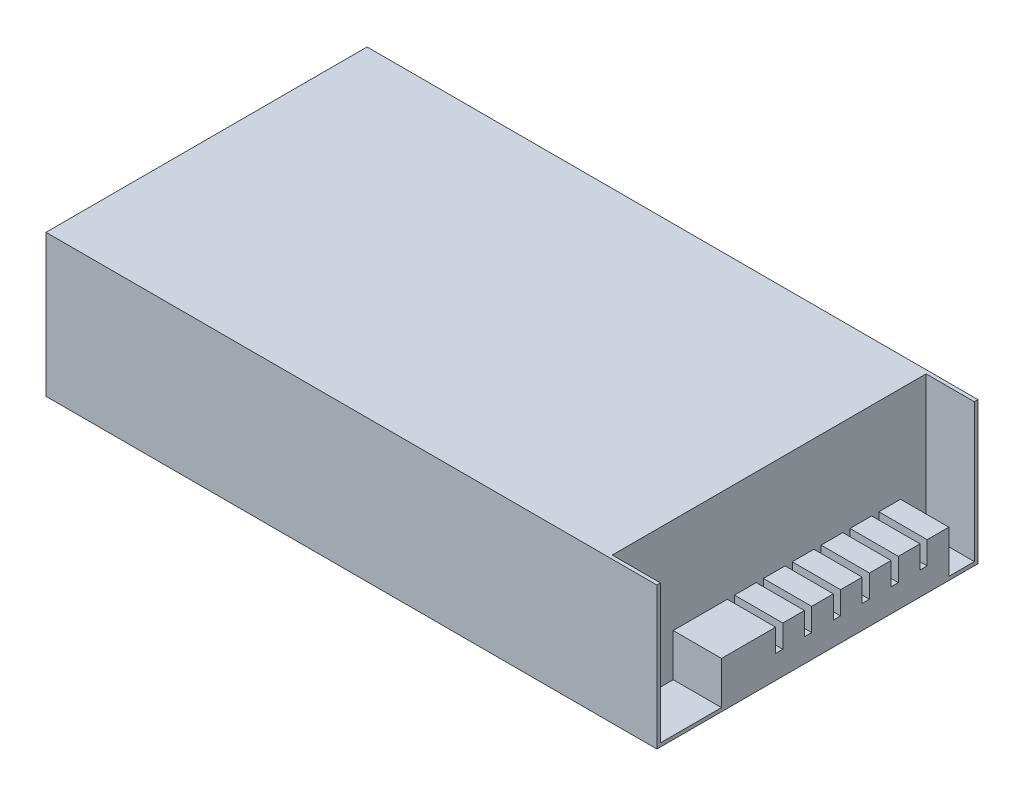
ISO-10303-21;
HEADER;
FILE_DESCRIPTION(('STEP AP214'),'2;1');
FILE_NAME('part.step','',(''),(''),'','','');
FILE_SCHEMA(('AUTOMOTIVE_DESIGN { 1 0 10303 214 1 1 1 1 }'));
ENDSEC;
DATA;
#1=APPLICATION_CONTEXT('core data for automotive mechanical design processes');
#2=APPLICATION_PROTOCOL_DEFINITION('international standard','automotive_design',2000,#1);
#3=PRODUCT_CONTEXT('',#1,'mechanical');
#4=PRODUCT('Part','Part','',(#3));
#5=PRODUCT_RELATED_PRODUCT_CATEGORY('part','',(#4));
#6=PRODUCT_DEFINITION_FORMATION('','',#4);
#7=PRODUCT_DEFINITION_CONTEXT('part definition',#1,'design');
#8=PRODUCT_DEFINITION('design','',#6,#7);
#9=PRODUCT_DEFINITION_SHAPE('','',#8);
#10=(LENGTH_UNIT() NAMED_UNIT(*) SI_UNIT(.MILLI.,.METRE.));
#11=(NAMED_UNIT(*) PLANE_ANGLE_UNIT() SI_UNIT($,.RADIAN.));
#12=(NAMED_UNIT(*) SI_UNIT($,.STERADIAN.) SOLID_ANGLE_UNIT());
#13=UNCERTAINTY_MEASURE_WITH_UNIT(LENGTH_MEASURE(1.E-05),#10,'distance_accuracy_value','');
#14=(GEOMETRIC_REPRESENTATION_CONTEXT(3) GLOBAL_UNCERTAINTY_ASSIGNED_CONTEXT((#13)) GLOBAL_UNIT_ASSIGNED_CONTEXT((#10,
#11,#12)) REPRESENTATION_CONTEXT('',''));
#15=CARTESIAN_POINT('',(0.,0.,0.));
#16=DIRECTION('',(0.,0.,1.));
#17=DIRECTION('',(1.,0.,0.));
#18=AXIS2_PLACEMENT_3D('',#15,#16,#17);
#19=CARTESIAN_POINT('',(215.,50.,0.));
#20=DIRECTION('',(-1.,0.,0.));
#21=DIRECTION('',(0.,0.,1.));
#22=AXIS2_PLACEMENT_3D('',#19,#20,#21);
#23=PLANE('',#22);
#24=DIRECTION('',(0.,1.,0.));
#25=VECTOR('',#24,1.);
#26=CARTESIAN_POINT('',(215.,8.27,-41.77));
#27=LINE('',#26,#25);
#28=CARTESIAN_POINT('',(215.,8.27,-41.77));
#29=VERTEX_POINT('',#28);
#30=CARTESIAN_POINT('',(215.,16.27,-41.77));
#31=VERTEX_POINT('',#30);
#32=EDGE_CURVE('E265',#29,#31,#27,.T.);
#33=ORIENTED_EDGE('',*,*,#32,.T.);
#34=DIRECTION('',(0.,0.,-1.));
#35=VECTOR('',#34,1.);
#36=CARTESIAN_POINT('',(215.,16.27,-22.73));
#37=LINE('',#36,#35);
#38=CARTESIAN_POINT('',(215.,16.27,-22.73));
#39=VERTEX_POINT('',#38);
#40=EDGE_CURVE('E442',#39,#31,#37,.T.);
#41=ORIENTED_EDGE('',*,*,#40,.F.);
#42=DIRECTION('',(0.,-1.,0.));
#43=VECTOR('',#42,1.);
#44=CARTESIAN_POINT('',(215.,16.27,-22.73));
#45=LINE('',#44,#43);
#46=CARTESIAN_POINT('',(215.,1.27,-22.73));
#47=VERTEX_POINT('',#46);
#48=EDGE_CURVE('E456',#39,#47,#45,.T.);
#49=ORIENTED_EDGE('',*,*,#48,.T.);
#50=DIRECTION('',(0.,0.,-1.));
#51=VECTOR('',#50,1.);
#52=CARTESIAN_POINT('',(215.,1.27,-1.27000000000001));
#53=LINE('',#52,#51);
#54=CARTESIAN_POINT('',(215.,1.27,-1.27000000000001));
#55=VERTEX_POINT('',#54);
#56=EDGE_CURVE('E491',#55,#47,#53,.T.);
#57=ORIENTED_EDGE('',*,*,#56,.F.);
#58=DIRECTION('',(0.,-1.,0.));
#59=VECTOR('',#58,1.);
#60=CARTESIAN_POINT('',(215.,50.,-1.27));
#61=LINE('',#60,#59);
#62=CARTESIAN_POINT('',(215.,50.,-1.27));
#63=VERTEX_POINT('',#62);
#64=EDGE_CURVE('E472',#63,#55,#61,.T.);
#65=ORIENTED_EDGE('',*,*,#64,.F.);
#66=DIRECTION('',(0.,0.,-1.));
#67=VECTOR('',#66,1.);
#68=CARTESIAN_POINT('',(215.,50.,0.));
#69=LINE('',#68,#67);
#70=CARTESIAN_POINT('',(215.,50.,0.));
#71=VERTEX_POINT('',#70);
#72=EDGE_CURVE('E512',#71,#63,#69,.T.);
#73=ORIENTED_EDGE('',*,*,#72,.F.);
#74=DIRECTION('',(0.,-1.,0.));
#75=VECTOR('',#74,1.);
#76=CARTESIAN_POINT('',(215.,50.,0.));
#77=LINE('',#76,#75);
#78=CARTESIAN_POINT('',(215.,0.,0.));
#79=VERTEX_POINT('',#78);
#80=EDGE_CURVE('E41',#71,#79,#77,.T.);
#81=ORIENTED_EDGE('',*,*,#80,.T.);
#82=DIRECTION('',(0.,0.,-1.));
#83=VECTOR('',#82,1.);
#84=CARTESIAN_POINT('',(215.,0.,0.));
#85=LINE('',#84,#83);
#86=CARTESIAN_POINT('',(215.,0.,-113.));
#87=VERTEX_POINT('',#86);
#88=EDGE_CURVE('E522',#79,#87,#85,.T.);
#89=ORIENTED_EDGE('',*,*,#88,.T.);
#90=DIRECTION('',(0.,-1.,0.));
#91=VECTOR('',#90,1.);
#92=CARTESIAN_POINT('',(215.,50.,-113.));
#93=LINE('',#92,#91);
#94=CARTESIAN_POINT('',(215.,50.,-113.));
#95=VERTEX_POINT('',#94);
#96=EDGE_CURVE('E527',#95,#87,#93,.T.);
#97=ORIENTED_EDGE('',*,*,#96,.F.);
#98=CARTESIAN_POINT('',(215.,50.,-111.73));
#99=VERTEX_POINT('',#98);
#100=EDGE_CURVE('E511',#99,#95,#69,.T.);
#101=ORIENTED_EDGE('',*,*,#100,.F.);
#102=DIRECTION('',(0.,-1.,0.));
#103=VECTOR('',#102,1.);
#104=CARTESIAN_POINT('',(215.,50.,-111.73));
#105=LINE('',#104,#103);
#106=CARTESIAN_POINT('',(215.,1.27,-111.73));
#107=VERTEX_POINT('',#106);
#108=EDGE_CURVE('E477',#99,#107,#105,.T.);
#109=ORIENTED_EDGE('',*,*,#108,.T.);
#110=CARTESIAN_POINT('',(215.,1.27,-102.73));
#111=VERTEX_POINT('',#110);
#112=EDGE_CURVE('E490',#111,#107,#53,.T.);
#113=ORIENTED_EDGE('',*,*,#112,.F.);
#114=DIRECTION('',(0.,-1.,0.));
#115=VECTOR('',#114,1.);
#116=CARTESIAN_POINT('',(215.,16.27,-102.73));
#117=LINE('',#116,#115);
#118=CARTESIAN_POINT('',(215.,16.27,-102.73));
#119=VERTEX_POINT('',#118);
#120=EDGE_CURVE('E469',#119,#111,#117,.T.);
#121=ORIENTED_EDGE('',*,*,#120,.F.);
#122=CARTESIAN_POINT('',(215.,16.27,-95.11));
#123=VERTEX_POINT('',#122);
#124=EDGE_CURVE('E446',#123,#119,#37,.T.);
#125=ORIENTED_EDGE('',*,*,#124,.F.);
#126=DIRECTION('',(0.,1.,0.));
#127=VECTOR('',#126,1.);
#128=CARTESIAN_POINT('',(215.,8.27,-95.11));
#129=LINE('',#128,#127);
#130=CARTESIAN_POINT('',(215.,8.27,-95.11));
#131=VERTEX_POINT('',#130);
#132=EDGE_CURVE('E426',#131,#123,#129,.T.);
#133=ORIENTED_EDGE('',*,*,#132,.F.);
#134=DIRECTION('',(0.,0.,-1.));
#135=VECTOR('',#134,1.);
#136=CARTESIAN_POINT('',(215.,8.27,0.));
#137=LINE('',#136,#135);
#138=CARTESIAN_POINT('',(215.,8.27,-92.57));
#139=VERTEX_POINT('',#138);
#140=EDGE_CURVE('E406',#139,#131,#137,.T.);
#141=ORIENTED_EDGE('',*,*,#140,.F.);
#142=DIRECTION('',(0.,1.,0.));
#143=VECTOR('',#142,1.);
#144=CARTESIAN_POINT('',(215.,8.27,-92.57));
#145=LINE('',#144,#143);
#146=CARTESIAN_POINT('',(215.,16.27,-92.57));
#147=VERTEX_POINT('',#146);
#148=EDGE_CURVE('E416',#139,#147,#145,.T.);
#149=ORIENTED_EDGE('',*,*,#148,.T.);
#150=CARTESIAN_POINT('',(215.,16.27,-84.95));
#151=VERTEX_POINT('',#150);
#152=EDGE_CURVE('E568',#151,#147,#37,.T.);
#153=ORIENTED_EDGE('',*,*,#152,.F.);
#154=DIRECTION('',(0.,1.,0.));
#155=VECTOR('',#154,1.);
#156=CARTESIAN_POINT('',(215.,8.27,-84.95));
#157=LINE('',#156,#155);
#158=CARTESIAN_POINT('',(215.,8.27,-84.95));
#159=VERTEX_POINT('',#158);
#160=EDGE_CURVE('E400',#159,#151,#157,.T.);
#161=ORIENTED_EDGE('',*,*,#160,.F.);
#162=DIRECTION('',(0.,0.,-1.));
#163=VECTOR('',#162,1.);
#164=CARTESIAN_POINT('',(215.,8.27,0.));
#165=LINE('',#164,#163);
#166=CARTESIAN_POINT('',(215.,8.27,-82.41));
#167=VERTEX_POINT('',#166);
#168=EDGE_CURVE('E380',#167,#159,#165,.T.);
#169=ORIENTED_EDGE('',*,*,#168,.F.);
#170=DIRECTION('',(0.,1.,0.));
#171=VECTOR('',#170,1.);
#172=CARTESIAN_POINT('',(215.,8.27,-82.41));
#173=LINE('',#172,#171);
#174=CARTESIAN_POINT('',(215.,16.27,-82.41));
#175=VERTEX_POINT('',#174);
#176=EDGE_CURVE('E390',#167,#175,#173,.T.);
#177=ORIENTED_EDGE('',*,*,#176,.T.);
#178=CARTESIAN_POINT('',(215.,16.27,-74.79));
#179=VERTEX_POINT('',#178);
#180=EDGE_CURVE('E569',#179,#175,#37,.T.);
#181=ORIENTED_EDGE('',*,*,#180,.F.);
#182=DIRECTION('',(0.,1.,0.));
#183=VECTOR('',#182,1.);
#184=CARTESIAN_POINT('',(215.,8.27,-74.79));
#185=LINE('',#184,#183);
#186=CARTESIAN_POINT('',(215.,8.27,-74.79));
#187=VERTEX_POINT('',#186);
#188=EDGE_CURVE('E374',#187,#179,#185,.T.);
#189=ORIENTED_EDGE('',*,*,#188,.F.);
#190=DIRECTION('',(0.,0.,-1.));
#191=VECTOR('',#190,1.);
#192=CARTESIAN_POINT('',(215.,8.27,0.));
#193=LINE('',#192,#191);
#194=CARTESIAN_POINT('',(215.,8.27,-72.25));
#195=VERTEX_POINT('',#194);
#196=EDGE_CURVE('E354',#195,#187,#193,.T.);
#197=ORIENTED_EDGE('',*,*,#196,.F.);
#198=DIRECTION('',(0.,1.,0.));
#199=VECTOR('',#198,1.);
#200=CARTESIAN_POINT('',(215.,8.27,-72.25));
#201=LINE('',#200,#199);
#202=CARTESIAN_POINT('',(215.,16.27,-72.25));
#203=VERTEX_POINT('',#202);
#204=EDGE_CURVE('E364',#195,#203,#201,.T.);
#205=ORIENTED_EDGE('',*,*,#204,.T.);
#206=CARTESIAN_POINT('',(215.,16.27,-64.63));
#207=VERTEX_POINT('',#206);
#208=EDGE_CURVE('E574',#207,#203,#37,.T.);
#209=ORIENTED_EDGE('',*,*,#208,.F.);
#210=DIRECTION('',(0.,1.,0.));
#211=VECTOR('',#210,1.);
#212=CARTESIAN_POINT('',(215.,8.27,-64.63));
#213=LINE('',#212,#211);
#214=CARTESIAN_POINT('',(215.,8.27,-64.63));
#215=VERTEX_POINT('',#214);
#216=EDGE_CURVE('E348',#215,#207,#213,.T.);
#217=ORIENTED_EDGE('',*,*,#216,.F.);
#218=DIRECTION('',(0.,0.,-1.));
#219=VECTOR('',#218,1.);
#220=CARTESIAN_POINT('',(215.,8.27,0.));
#221=LINE('',#220,#219);
#222=CARTESIAN_POINT('',(215.,8.27,-62.09));
#223=VERTEX_POINT('',#222);
#224=EDGE_CURVE('E328',#223,#215,#221,.T.);
#225=ORIENTED_EDGE('',*,*,#224,.F.);
#226=DIRECTION('',(0.,1.,0.));
#227=VECTOR('',#226,1.);
#228=CARTESIAN_POINT('',(215.,8.27,-62.09));
#229=LINE('',#228,#227);
#230=CARTESIAN_POINT('',(215.,16.27,-62.09));
#231=VERTEX_POINT('',#230);
#232=EDGE_CURVE('E338',#223,#231,#229,.T.);
#233=ORIENTED_EDGE('',*,*,#232,.T.);
#234=CARTESIAN_POINT('',(215.,16.27,-54.47));
#235=VERTEX_POINT('',#234);
#236=EDGE_CURVE('E579',#235,#231,#37,.T.);
#237=ORIENTED_EDGE('',*,*,#236,.F.);
#238=DIRECTION('',(0.,1.,0.));
#239=VECTOR('',#238,1.);
#240=CARTESIAN_POINT('',(215.,8.27,-54.47));
#241=LINE('',#240,#239);
#242=CARTESIAN_POINT('',(215.,8.27,-54.47));
#243=VERTEX_POINT('',#242);
#244=EDGE_CURVE('E322',#243,#235,#241,.T.);
#245=ORIENTED_EDGE('',*,*,#244,.F.);
#246=DIRECTION('',(0.,0.,-1.));
#247=VECTOR('',#246,1.);
#248=CARTESIAN_POINT('',(215.,8.27,0.));
#249=LINE('',#248,#247);
#250=CARTESIAN_POINT('',(215.,8.27,-51.93));
#251=VERTEX_POINT('',#250);
#252=EDGE_CURVE('E304',#251,#243,#249,.T.);
#253=ORIENTED_EDGE('',*,*,#252,.F.);
#254=DIRECTION('',(0.,1.,0.));
#255=VECTOR('',#254,1.);
#256=CARTESIAN_POINT('',(215.,8.27,-51.93));
#257=LINE('',#256,#255);
#258=CARTESIAN_POINT('',(215.,16.27,-51.93));
#259=VERTEX_POINT('',#258);
#260=EDGE_CURVE('E313',#251,#259,#257,.T.);
#261=ORIENTED_EDGE('',*,*,#260,.T.);
#262=CARTESIAN_POINT('',(215.,16.27,-44.31));
#263=VERTEX_POINT('',#262);
#264=EDGE_CURVE('E445',#263,#259,#37,.T.);
#265=ORIENTED_EDGE('',*,*,#264,.F.);
#266=DIRECTION('',(0.,1.,0.));
#267=VECTOR('',#266,1.);
#268=CARTESIAN_POINT('',(215.,8.27,-44.31));
#269=LINE('',#268,#267);
#270=CARTESIAN_POINT('',(215.,8.27,-44.31));
#271=VERTEX_POINT('',#270);
#272=EDGE_CURVE('E276',#271,#263,#269,.T.);
#273=ORIENTED_EDGE('',*,*,#272,.F.);
#274=DIRECTION('',(0.,0.,-1.));
#275=VECTOR('',#274,1.);
#276=CARTESIAN_POINT('',(215.,8.27,0.));
#277=LINE('',#276,#275);
#278=EDGE_CURVE('E284',#29,#271,#277,.T.);
#279=ORIENTED_EDGE('',*,*,#278,.F.);
#280=EDGE_LOOP('',(#33,#41,#49,#57,#65,#73,#81,#89,#97,#101,#109,#113,#121,#125,#133,#141,#149,
#153,#161,#169,#177,#181,#189,#197,#205,#209,#217,#225,#233,#237,#245,#253,#261,#265,#273,#279));
#281=FACE_BOUND('',#280,.T.);
#282=ADVANCED_FACE('F33',(#281),#23,.F.);
#283=CARTESIAN_POINT('',(0.,16.27,0.));
#284=DIRECTION('',(0.,1.,0.));
#285=DIRECTION('',(0.,0.,1.));
#286=AXIS2_PLACEMENT_3D('',#283,#284,#285);
#287=PLANE('',#286);
#288=ORIENTED_EDGE('',*,*,#40,.T.);
#289=DIRECTION('',(-1.,0.,0.));
#290=VECTOR('',#289,1.);
#291=CARTESIAN_POINT('',(0.,16.27,-41.77));
#292=LINE('',#291,#290);
#293=CARTESIAN_POINT('',(198.,16.27,-41.77));
#294=VERTEX_POINT('',#293);
#295=EDGE_CURVE('E271',#31,#294,#292,.T.);
#296=ORIENTED_EDGE('',*,*,#295,.T.);
#297=DIRECTION('',(0.,0.,1.));
#298=VECTOR('',#297,1.);
#299=CARTESIAN_POINT('',(198.,16.27,-22.73));
#300=LINE('',#299,#298);
#301=CARTESIAN_POINT('',(198.,16.27,-22.73));
#302=VERTEX_POINT('',#301);
#303=EDGE_CURVE('E449',#294,#302,#300,.T.);
#304=ORIENTED_EDGE('',*,*,#303,.T.);
#305=DIRECTION('',(1.,0.,0.));
#306=VECTOR('',#305,1.);
#307=CARTESIAN_POINT('',(215.,16.27,-22.73));
#308=LINE('',#307,#306);
#309=EDGE_CURVE('E453',#302,#39,#308,.T.);
#310=ORIENTED_EDGE('',*,*,#309,.T.);
#311=EDGE_LOOP('',(#288,#296,#304,#310));
#312=FACE_BOUND('',#311,.T.);
#313=ADVANCED_FACE('F610',(#312),#287,.T.);
#314=DIRECTION('',(-1.,0.,0.));
#315=VECTOR('',#314,1.);
#316=CARTESIAN_POINT('',(0.,16.27,-44.31));
#317=LINE('',#316,#315);
#318=CARTESIAN_POINT('',(198.,16.27,-44.31));
#319=VERTEX_POINT('',#318);
#320=EDGE_CURVE('E48',#263,#319,#317,.T.);
#321=ORIENTED_EDGE('',*,*,#320,.F.);
#322=ORIENTED_EDGE('',*,*,#264,.T.);
#323=DIRECTION('',(-1.,0.,0.));
#324=VECTOR('',#323,1.);
#325=CARTESIAN_POINT('',(0.,16.27,-51.93));
#326=LINE('',#325,#324);
#327=CARTESIAN_POINT('',(198.,16.27,-51.93));
#328=VERTEX_POINT('',#327);
#329=EDGE_CURVE('E298',#259,#328,#326,.T.);
#330=ORIENTED_EDGE('',*,*,#329,.T.);
#331=EDGE_CURVE('E603',#328,#319,#300,.T.);
#332=ORIENTED_EDGE('',*,*,#331,.T.);
#333=EDGE_LOOP('',(#321,#322,#330,#332));
#334=FACE_BOUND('',#333,.T.);
#335=ADVANCED_FACE('F589',(#334),#287,.T.);
#336=DIRECTION('',(-1.,0.,0.));
#337=VECTOR('',#336,1.);
#338=CARTESIAN_POINT('',(0.,16.27,-54.47));
#339=LINE('',#338,#337);
#340=CARTESIAN_POINT('',(198.,16.27,-54.47));
#341=VERTEX_POINT('',#340);
#342=EDGE_CURVE('E56',#235,#341,#339,.T.);
#343=ORIENTED_EDGE('',*,*,#342,.F.);
#344=ORIENTED_EDGE('',*,*,#236,.T.);
#345=DIRECTION('',(-1.,0.,0.));
#346=VECTOR('',#345,1.);
#347=CARTESIAN_POINT('',(0.,16.27,-62.09));
#348=LINE('',#347,#346);
#349=CARTESIAN_POINT('',(198.,16.27,-62.09));
#350=VERTEX_POINT('',#349);
#351=EDGE_CURVE('E319',#231,#350,#348,.T.);
#352=ORIENTED_EDGE('',*,*,#351,.T.);
#353=EDGE_CURVE('E604',#350,#341,#300,.T.);
#354=ORIENTED_EDGE('',*,*,#353,.T.);
#355=EDGE_LOOP('',(#343,#344,#352,#354));
#356=FACE_BOUND('',#355,.T.);
#357=ADVANCED_FACE('F852',(#356),#287,.T.);
#358=DIRECTION('',(-1.,0.,0.));
#359=VECTOR('',#358,1.);
#360=CARTESIAN_POINT('',(0.,16.27,-64.63));
#361=LINE('',#360,#359);
#362=CARTESIAN_POINT('',(198.,16.27,-64.63));
#363=VERTEX_POINT('',#362);
#364=EDGE_CURVE('E329',#207,#363,#361,.T.);
#365=ORIENTED_EDGE('',*,*,#364,.F.);
#366=ORIENTED_EDGE('',*,*,#208,.T.);
#367=DIRECTION('',(-1.,0.,0.));
#368=VECTOR('',#367,1.);
#369=CARTESIAN_POINT('',(0.,16.27,-72.25));
#370=LINE('',#369,#368);
#371=CARTESIAN_POINT('',(198.,16.27,-72.25));
#372=VERTEX_POINT('',#371);
#373=EDGE_CURVE('E344',#203,#372,#370,.T.);
#374=ORIENTED_EDGE('',*,*,#373,.T.);
#375=EDGE_CURVE('E606',#372,#363,#300,.T.);
#376=ORIENTED_EDGE('',*,*,#375,.T.);
#377=EDGE_LOOP('',(#365,#366,#374,#376));
#378=FACE_BOUND('',#377,.T.);
#379=ADVANCED_FACE('F860',(#378),#287,.T.);
#380=DIRECTION('',(-1.,0.,0.));
#381=VECTOR('',#380,1.);
#382=CARTESIAN_POINT('',(0.,16.27,-74.79));
#383=LINE('',#382,#381);
#384=CARTESIAN_POINT('',(198.,16.27,-74.79));
#385=VERTEX_POINT('',#384);
#386=EDGE_CURVE('E355',#179,#385,#383,.T.);
#387=ORIENTED_EDGE('',*,*,#386,.F.);
#388=ORIENTED_EDGE('',*,*,#180,.T.);
#389=DIRECTION('',(-1.,0.,0.));
#390=VECTOR('',#389,1.);
#391=CARTESIAN_POINT('',(0.,16.27,-82.41));
#392=LINE('',#391,#390);
#393=CARTESIAN_POINT('',(198.,16.27,-82.41));
#394=VERTEX_POINT('',#393);
#395=EDGE_CURVE('E370',#175,#394,#392,.T.);
#396=ORIENTED_EDGE('',*,*,#395,.T.);
#397=EDGE_CURVE('E1037',#394,#385,#300,.T.);
#398=ORIENTED_EDGE('',*,*,#397,.T.);
#399=EDGE_LOOP('',(#387,#388,#396,#398));
#400=FACE_BOUND('',#399,.T.);
#401=ADVANCED_FACE('F639',(#400),#287,.T.);
#402=DIRECTION('',(-1.,0.,0.));
#403=VECTOR('',#402,1.);
#404=CARTESIAN_POINT('',(0.,16.27,-84.95));
#405=LINE('',#404,#403);
#406=CARTESIAN_POINT('',(198.,16.27,-84.95));
#407=VERTEX_POINT('',#406);
#408=EDGE_CURVE('E381',#151,#407,#405,.T.);
#409=ORIENTED_EDGE('',*,*,#408,.F.);
#410=ORIENTED_EDGE('',*,*,#152,.T.);
#411=DIRECTION('',(-1.,0.,0.));
#412=VECTOR('',#411,1.);
#413=CARTESIAN_POINT('',(0.,16.27,-92.57));
#414=LINE('',#413,#412);
#415=CARTESIAN_POINT('',(198.,16.27,-92.57));
#416=VERTEX_POINT('',#415);
#417=EDGE_CURVE('E396',#147,#416,#414,.T.);
#418=ORIENTED_EDGE('',*,*,#417,.T.);
#419=EDGE_CURVE('E454',#416,#407,#300,.T.);
#420=ORIENTED_EDGE('',*,*,#419,.T.);
#421=EDGE_LOOP('',(#409,#410,#418,#420));
#422=FACE_BOUND('',#421,.T.);
#423=ADVANCED_FACE('F628',(#422),#287,.T.);
#424=CARTESIAN_POINT('',(198.,1.27,-1.27000000000001));
#425=DIRECTION('',(0.,-1.,0.));
#426=DIRECTION('',(0.,0.,-1.));
#427=AXIS2_PLACEMENT_3D('',#424,#425,#426);
#428=PLANE('',#427);
#429=DIRECTION('',(-1.,0.,0.));
#430=VECTOR('',#429,1.);
#431=CARTESIAN_POINT('',(215.,1.27,-102.73));
#432=LINE('',#431,#430);
#433=CARTESIAN_POINT('',(198.,1.27,-102.73));
#434=VERTEX_POINT('',#433);
#435=EDGE_CURVE('E439',#111,#434,#432,.T.);
#436=ORIENTED_EDGE('',*,*,#435,.F.);
#437=ORIENTED_EDGE('',*,*,#112,.T.);
#438=DIRECTION('',(1.,0.,0.));
#439=VECTOR('',#438,1.);
#440=CARTESIAN_POINT('',(198.,1.27,-111.73));
#441=LINE('',#440,#439);
#442=CARTESIAN_POINT('',(198.,1.27,-111.73));
#443=VERTEX_POINT('',#442);
#444=EDGE_CURVE('E501',#443,#107,#441,.T.);
#445=ORIENTED_EDGE('',*,*,#444,.F.);
#446=DIRECTION('',(0.,0.,-1.));
#447=VECTOR('',#446,1.);
#448=CARTESIAN_POINT('',(198.,1.27,-1.27000000000001));
#449=LINE('',#448,#447);
#450=EDGE_CURVE('E476',#434,#443,#449,.T.);
#451=ORIENTED_EDGE('',*,*,#450,.F.);
#452=EDGE_LOOP('',(#436,#437,#445,#451));
#453=FACE_BOUND('',#452,.T.);
#454=ADVANCED_FACE('F558',(#453),#428,.F.);
#455=DIRECTION('',(1.,0.,0.));
#456=VECTOR('',#455,1.);
#457=CARTESIAN_POINT('',(215.,1.27,-22.73));
#458=LINE('',#457,#456);
#459=CARTESIAN_POINT('',(198.,1.27,-22.73));
#460=VERTEX_POINT('',#459);
#461=EDGE_CURVE('E459',#460,#47,#458,.T.);
#462=ORIENTED_EDGE('',*,*,#461,.F.);
#463=CARTESIAN_POINT('',(198.,1.27,-1.27000000000001));
#464=VERTEX_POINT('',#463);
#465=EDGE_CURVE('E478',#464,#460,#449,.T.);
#466=ORIENTED_EDGE('',*,*,#465,.F.);
#467=DIRECTION('',(1.,0.,0.));
#468=VECTOR('',#467,1.);
#469=CARTESIAN_POINT('',(198.,1.27,-1.27000000000001));
#470=LINE('',#469,#468);
#471=EDGE_CURVE('E487',#464,#55,#470,.T.);
#472=ORIENTED_EDGE('',*,*,#471,.T.);
#473=ORIENTED_EDGE('',*,*,#56,.T.);
#474=EDGE_LOOP('',(#462,#466,#472,#473));
#475=FACE_BOUND('',#474,.T.);
#476=ADVANCED_FACE('F618',(#475),#428,.F.);
#477=CARTESIAN_POINT('',(198.,0.,0.));
#478=DIRECTION('',(1.,0.,0.));
#479=DIRECTION('',(0.,0.,-1.));
#480=AXIS2_PLACEMENT_3D('',#477,#478,#479);
#481=PLANE('',#480);
#482=CARTESIAN_POINT('',(198.,16.27,-102.73));
#483=VERTEX_POINT('',#482);
#484=CARTESIAN_POINT('',(198.,16.27,-95.11));
#485=VERTEX_POINT('',#484);
#486=EDGE_CURVE('E450',#483,#485,#300,.T.);
#487=ORIENTED_EDGE('',*,*,#486,.F.);
#488=DIRECTION('',(0.,-1.,0.));
#489=VECTOR('',#488,1.);
#490=CARTESIAN_POINT('',(198.,16.27,-102.73));
#491=LINE('',#490,#489);
#492=EDGE_CURVE('E467',#483,#434,#491,.T.);
#493=ORIENTED_EDGE('',*,*,#492,.T.);
#494=ORIENTED_EDGE('',*,*,#450,.T.);
#495=DIRECTION('',(0.,-1.,0.));
#496=VECTOR('',#495,1.);
#497=CARTESIAN_POINT('',(198.,50.,-111.73));
#498=LINE('',#497,#496);
#499=CARTESIAN_POINT('',(198.,50.,-111.73));
#500=VERTEX_POINT('',#499);
#501=EDGE_CURVE('E481',#500,#443,#498,.T.);
#502=ORIENTED_EDGE('',*,*,#501,.F.);
#503=DIRECTION('',(0.,0.,-1.));
#504=VECTOR('',#503,1.);
#505=CARTESIAN_POINT('',(198.,50.,-1.27));
#506=LINE('',#505,#504);
#507=CARTESIAN_POINT('',(198.,50.,-1.27));
#508=VERTEX_POINT('',#507);
#509=EDGE_CURVE('E484',#508,#500,#506,.T.);
#510=ORIENTED_EDGE('',*,*,#509,.F.);
#511=DIRECTION('',(0.,-1.,0.));
#512=VECTOR('',#511,1.);
#513=CARTESIAN_POINT('',(198.,50.,-1.27));
#514=LINE('',#513,#512);
#515=EDGE_CURVE('E473',#508,#464,#514,.T.);
#516=ORIENTED_EDGE('',*,*,#515,.T.);
#517=ORIENTED_EDGE('',*,*,#465,.T.);
#518=DIRECTION('',(0.,-1.,0.));
#519=VECTOR('',#518,1.);
#520=CARTESIAN_POINT('',(198.,16.27,-22.73));
#521=LINE('',#520,#519);
#522=EDGE_CURVE('E464',#302,#460,#521,.T.);
#523=ORIENTED_EDGE('',*,*,#522,.F.);
#524=ORIENTED_EDGE('',*,*,#303,.F.);
#525=DIRECTION('',(0.,1.,0.));
#526=VECTOR('',#525,1.);
#527=CARTESIAN_POINT('',(198.,8.27,-41.77));
#528=LINE('',#527,#526);
#529=CARTESIAN_POINT('',(198.,8.27,-41.77));
#530=VERTEX_POINT('',#529);
#531=EDGE_CURVE('E296',#530,#294,#528,.T.);
#532=ORIENTED_EDGE('',*,*,#531,.F.);
#533=DIRECTION('',(0.,0.,1.));
#534=VECTOR('',#533,1.);
#535=CARTESIAN_POINT('',(198.,8.27,0.));
#536=LINE('',#535,#534);
#537=CARTESIAN_POINT('',(198.,8.27,-44.31));
#538=VERTEX_POINT('',#537);
#539=EDGE_CURVE('E277',#538,#530,#536,.T.);
#540=ORIENTED_EDGE('',*,*,#539,.F.);
#541=DIRECTION('',(0.,1.,0.));
#542=VECTOR('',#541,1.);
#543=CARTESIAN_POINT('',(198.,8.27,-44.31));
#544=LINE('',#543,#542);
#545=EDGE_CURVE('E299',#538,#319,#544,.T.);
#546=ORIENTED_EDGE('',*,*,#545,.T.);
#547=ORIENTED_EDGE('',*,*,#331,.F.);
#548=DIRECTION('',(0.,1.,0.));
#549=VECTOR('',#548,1.);
#550=CARTESIAN_POINT('',(198.,8.27,-51.93));
#551=LINE('',#550,#549);
#552=CARTESIAN_POINT('',(198.,8.27,-51.93));
#553=VERTEX_POINT('',#552);
#554=EDGE_CURVE('E317',#553,#328,#551,.T.);
#555=ORIENTED_EDGE('',*,*,#554,.F.);
#556=DIRECTION('',(0.,0.,1.));
#557=VECTOR('',#556,1.);
#558=CARTESIAN_POINT('',(198.,8.27,0.));
#559=LINE('',#558,#557);
#560=CARTESIAN_POINT('',(198.,8.27,-54.47));
#561=VERTEX_POINT('',#560);
#562=EDGE_CURVE('E310',#561,#553,#559,.T.);
#563=ORIENTED_EDGE('',*,*,#562,.F.);
#564=DIRECTION('',(0.,1.,0.));
#565=VECTOR('',#564,1.);
#566=CARTESIAN_POINT('',(198.,8.27,-54.47));
#567=LINE('',#566,#565);
#568=EDGE_CURVE('E320',#561,#341,#567,.T.);
#569=ORIENTED_EDGE('',*,*,#568,.T.);
#570=ORIENTED_EDGE('',*,*,#353,.F.);
#571=DIRECTION('',(0.,1.,0.));
#572=VECTOR('',#571,1.);
#573=CARTESIAN_POINT('',(198.,8.27,-62.09));
#574=LINE('',#573,#572);
#575=CARTESIAN_POINT('',(198.,8.27,-62.09));
#576=VERTEX_POINT('',#575);
#577=EDGE_CURVE('E342',#576,#350,#574,.T.);
#578=ORIENTED_EDGE('',*,*,#577,.F.);
#579=DIRECTION('',(0.,0.,1.));
#580=VECTOR('',#579,1.);
#581=CARTESIAN_POINT('',(198.,8.27,0.));
#582=LINE('',#581,#580);
#583=CARTESIAN_POINT('',(198.,8.27,-64.63));
#584=VERTEX_POINT('',#583);
#585=EDGE_CURVE('E335',#584,#576,#582,.T.);
#586=ORIENTED_EDGE('',*,*,#585,.F.);
#587=DIRECTION('',(0.,1.,0.));
#588=VECTOR('',#587,1.);
#589=CARTESIAN_POINT('',(198.,8.27,-64.63));
#590=LINE('',#589,#588);
#591=EDGE_CURVE('E345',#584,#363,#590,.T.);
#592=ORIENTED_EDGE('',*,*,#591,.T.);
#593=ORIENTED_EDGE('',*,*,#375,.F.);
#594=DIRECTION('',(0.,1.,0.));
#595=VECTOR('',#594,1.);
#596=CARTESIAN_POINT('',(198.,8.27,-72.25));
#597=LINE('',#596,#595);
#598=CARTESIAN_POINT('',(198.,8.27,-72.25));
#599=VERTEX_POINT('',#598);
#600=EDGE_CURVE('E368',#599,#372,#597,.T.);
#601=ORIENTED_EDGE('',*,*,#600,.F.);
#602=DIRECTION('',(0.,0.,1.));
#603=VECTOR('',#602,1.);
#604=CARTESIAN_POINT('',(198.,8.27,0.));
#605=LINE('',#604,#603);
#606=CARTESIAN_POINT('',(198.,8.27,-74.79));
#607=VERTEX_POINT('',#606);
#608=EDGE_CURVE('E361',#607,#599,#605,.T.);
#609=ORIENTED_EDGE('',*,*,#608,.F.);
#610=DIRECTION('',(0.,1.,0.));
#611=VECTOR('',#610,1.);
#612=CARTESIAN_POINT('',(198.,8.27,-74.79));
#613=LINE('',#612,#611);
#614=EDGE_CURVE('E371',#607,#385,#613,.T.);
#615=ORIENTED_EDGE('',*,*,#614,.T.);
#616=ORIENTED_EDGE('',*,*,#397,.F.);
#617=DIRECTION('',(0.,1.,0.));
#618=VECTOR('',#617,1.);
#619=CARTESIAN_POINT('',(198.,8.27,-82.41));
#620=LINE('',#619,#618);
#621=CARTESIAN_POINT('',(198.,8.27,-82.41));
#622=VERTEX_POINT('',#621);
#623=EDGE_CURVE('E394',#622,#394,#620,.T.);
#624=ORIENTED_EDGE('',*,*,#623,.F.);
#625=DIRECTION('',(0.,0.,1.));
#626=VECTOR('',#625,1.);
#627=CARTESIAN_POINT('',(198.,8.27,0.));
#628=LINE('',#627,#626);
#629=CARTESIAN_POINT('',(198.,8.27,-84.95));
#630=VERTEX_POINT('',#629);
#631=EDGE_CURVE('E387',#630,#622,#628,.T.);
#632=ORIENTED_EDGE('',*,*,#631,.F.);
#633=DIRECTION('',(0.,1.,0.));
#634=VECTOR('',#633,1.);
#635=CARTESIAN_POINT('',(198.,8.27,-84.95));
#636=LINE('',#635,#634);
#637=EDGE_CURVE('E397',#630,#407,#636,.T.);
#638=ORIENTED_EDGE('',*,*,#637,.T.);
#639=ORIENTED_EDGE('',*,*,#419,.F.);
#640=DIRECTION('',(0.,1.,0.));
#641=VECTOR('',#640,1.);
#642=CARTESIAN_POINT('',(198.,8.27,-92.57));
#643=LINE('',#642,#641);
#644=CARTESIAN_POINT('',(198.,8.27,-92.57));
#645=VERTEX_POINT('',#644);
#646=EDGE_CURVE('E421',#645,#416,#643,.T.);
#647=ORIENTED_EDGE('',*,*,#646,.F.);
#648=DIRECTION('',(0.,0.,1.));
#649=VECTOR('',#648,1.);
#650=CARTESIAN_POINT('',(198.,8.27,0.));
#651=LINE('',#650,#649);
#652=CARTESIAN_POINT('',(198.,8.27,-95.11));
#653=VERTEX_POINT('',#652);
#654=EDGE_CURVE('E413',#653,#645,#651,.T.);
#655=ORIENTED_EDGE('',*,*,#654,.F.);
#656=DIRECTION('',(0.,1.,0.));
#657=VECTOR('',#656,1.);
#658=CARTESIAN_POINT('',(198.,8.27,-95.11));
#659=LINE('',#658,#657);
#660=EDGE_CURVE('E424',#653,#485,#659,.T.);
#661=ORIENTED_EDGE('',*,*,#660,.T.);
#662=EDGE_LOOP('',(#487,#493,#494,#502,#510,#516,#517,#523,#524,#532,#540,#546,#547,#555,#563,
#569,#570,#578,#586,#592,#593,#601,#609,#615,#616,#624,#632,#638,#639,#647,#655,#661));
#663=FACE_BOUND('',#662,.T.);
#664=ADVANCED_FACE('F602',(#663),#481,.T.);
#665=CARTESIAN_POINT('',(0.,50.,0.));
#666=DIRECTION('',(1.,0.,0.));
#667=DIRECTION('',(0.,0.,-1.));
#668=AXIS2_PLACEMENT_3D('',#665,#666,#667);
#669=PLANE('',#668);
#670=DIRECTION('',(0.,0.,1.));
#671=VECTOR('',#670,1.);
#672=CARTESIAN_POINT('',(0.,0.,0.));
#673=LINE('',#672,#671);
#674=CARTESIAN_POINT('',(0.,0.,-113.));
#675=VERTEX_POINT('',#674);
#676=CARTESIAN_POINT('',(0.,0.,0.));
#677=VERTEX_POINT('',#676);
#678=EDGE_CURVE('E497',#675,#677,#673,.T.);
#679=ORIENTED_EDGE('',*,*,#678,.T.);
#680=DIRECTION('',(0.,-1.,0.));
#681=VECTOR('',#680,1.);
#682=CARTESIAN_POINT('',(0.,50.,0.));
#683=LINE('',#682,#681);
#684=CARTESIAN_POINT('',(0.,50.,0.));
#685=VERTEX_POINT('',#684);
#686=EDGE_CURVE('E11',#685,#677,#683,.T.);
#687=ORIENTED_EDGE('',*,*,#686,.F.);
#688=DIRECTION('',(0.,0.,1.));
#689=VECTOR('',#688,1.);
#690=CARTESIAN_POINT('',(0.,50.,0.));
#691=LINE('',#690,#689);
#692=CARTESIAN_POINT('',(0.,50.,-113.));
#693=VERTEX_POINT('',#692);
#694=EDGE_CURVE('E505',#693,#685,#691,.T.);
#695=ORIENTED_EDGE('',*,*,#694,.F.);
#696=DIRECTION('',(0.,-1.,0.));
#697=VECTOR('',#696,1.);
#698=CARTESIAN_POINT('',(0.,50.,-113.));
#699=LINE('',#698,#697);
#700=EDGE_CURVE('E517',#693,#675,#699,.T.);
#701=ORIENTED_EDGE('',*,*,#700,.T.);
#702=EDGE_LOOP('',(#679,#687,#695,#701));
#703=FACE_BOUND('',#702,.T.);
#704=ADVANCED_FACE('F35',(#703),#669,.F.);
#705=CARTESIAN_POINT('',(0.,50.,0.));
#706=DIRECTION('',(0.,0.,-1.));
#707=DIRECTION('',(-1.,0.,0.));
#708=AXIS2_PLACEMENT_3D('',#705,#706,#707);
#709=PLANE('',#708);
#710=DIRECTION('',(1.,0.,0.));
#711=VECTOR('',#710,1.);
#712=CARTESIAN_POINT('',(0.,0.,0.));
#713=LINE('',#712,#711);
#714=EDGE_CURVE('E520',#677,#79,#713,.T.);
#715=ORIENTED_EDGE('',*,*,#714,.T.);
#716=ORIENTED_EDGE('',*,*,#80,.F.);
#717=DIRECTION('',(1.,0.,0.));
#718=VECTOR('',#717,1.);
#719=CARTESIAN_POINT('',(0.,50.,0.));
#720=LINE('',#719,#718);
#721=EDGE_CURVE('E508',#685,#71,#720,.T.);
#722=ORIENTED_EDGE('',*,*,#721,.F.);
#723=ORIENTED_EDGE('',*,*,#686,.T.);
#724=EDGE_LOOP('',(#715,#716,#722,#723));
#725=FACE_BOUND('',#724,.T.);
#726=ADVANCED_FACE('F646',(#725),#709,.F.);
#727=CARTESIAN_POINT('',(0.,50.,-113.));
#728=DIRECTION('',(0.,0.,1.));
#729=DIRECTION('',(1.,0.,0.));
#730=AXIS2_PLACEMENT_3D('',#727,#728,#729);
#731=PLANE('',#730);
#732=DIRECTION('',(-1.,0.,0.));
#733=VECTOR('',#732,1.);
#734=CARTESIAN_POINT('',(0.,0.,-113.));
#735=LINE('',#734,#733);
#736=EDGE_CURVE('E509',#87,#675,#735,.T.);
#737=ORIENTED_EDGE('',*,*,#736,.T.);
#738=ORIENTED_EDGE('',*,*,#700,.F.);
#739=DIRECTION('',(-1.,0.,0.));
#740=VECTOR('',#739,1.);
#741=CARTESIAN_POINT('',(0.,50.,-113.));
#742=LINE('',#741,#740);
#743=EDGE_CURVE('E515',#95,#693,#742,.T.);
#744=ORIENTED_EDGE('',*,*,#743,.F.);
#745=ORIENTED_EDGE('',*,*,#96,.T.);
#746=EDGE_LOOP('',(#737,#738,#744,#745));
#747=FACE_BOUND('',#746,.T.);
#748=ADVANCED_FACE('F542',(#747),#731,.F.);
#749=CARTESIAN_POINT('',(0.,50.,0.));
#750=DIRECTION('',(0.,-1.,0.));
#751=DIRECTION('',(0.,0.,-1.));
#752=AXIS2_PLACEMENT_3D('',#749,#750,#751);
#753=PLANE('',#752);
#754=ORIENTED_EDGE('',*,*,#72,.T.);
#755=DIRECTION('',(1.,0.,0.));
#756=VECTOR('',#755,1.);
#757=CARTESIAN_POINT('',(198.,50.,-1.27));
#758=LINE('',#757,#756);
#759=EDGE_CURVE('E495',#508,#63,#758,.T.);
#760=ORIENTED_EDGE('',*,*,#759,.F.);
#761=ORIENTED_EDGE('',*,*,#509,.T.);
#762=DIRECTION('',(1.,0.,0.));
#763=VECTOR('',#762,1.);
#764=CARTESIAN_POINT('',(198.,50.,-111.73));
#765=LINE('',#764,#763);
#766=EDGE_CURVE('E498',#500,#99,#765,.T.);
#767=ORIENTED_EDGE('',*,*,#766,.T.);
#768=ORIENTED_EDGE('',*,*,#100,.T.);
#769=ORIENTED_EDGE('',*,*,#743,.T.);
#770=ORIENTED_EDGE('',*,*,#694,.T.);
#771=ORIENTED_EDGE('',*,*,#721,.T.);
#772=EDGE_LOOP('',(#754,#760,#761,#767,#768,#769,#770,#771));
#773=FACE_BOUND('',#772,.T.);
#774=ADVANCED_FACE('F548',(#773),#753,.F.);
#775=CARTESIAN_POINT('',(0.,0.,0.));
#776=DIRECTION('',(0.,-1.,0.));
#777=DIRECTION('',(0.,0.,-1.));
#778=AXIS2_PLACEMENT_3D('',#775,#776,#777);
#779=PLANE('',#778);
#780=CARTESIAN_POINT('',(190.87,0.,-65.278));
#781=DIRECTION('',(0.,-1.,0.));
#782=DIRECTION('',(0.,0.,-1.));
#783=AXIS2_PLACEMENT_3D('',#780,#781,#782);
#784=CIRCLE('',#783,1.27000000000001);
#785=CARTESIAN_POINT('',(190.87,0.,-66.548));
#786=VERTEX_POINT('',#785);
#787=EDGE_CURVE('E423',#786,#786,#784,.T.);
#788=ORIENTED_EDGE('',*,*,#787,.F.);
#789=EDGE_LOOP('',(#788));
#790=FACE_BOUND('',#789,.T.);
#791=CARTESIAN_POINT('',(113.146,0.,-65.278));
#792=DIRECTION('',(0.,-1.,0.));
#793=DIRECTION('',(0.,0.,-1.));
#794=AXIS2_PLACEMENT_3D('',#791,#792,#793);
#795=CIRCLE('',#794,1.26999999999999);
#796=CARTESIAN_POINT('',(113.146,0.,-66.548));
#797=VERTEX_POINT('',#796);
#798=EDGE_CURVE('E433',#797,#797,#795,.T.);
#799=ORIENTED_EDGE('',*,*,#798,.F.);
#800=EDGE_LOOP('',(#799));
#801=FACE_BOUND('',#800,.T.);
#802=ORIENTED_EDGE('',*,*,#678,.F.);
#803=ORIENTED_EDGE('',*,*,#736,.F.);
#804=ORIENTED_EDGE('',*,*,#88,.F.);
#805=ORIENTED_EDGE('',*,*,#714,.F.);
#806=EDGE_LOOP('',(#802,#803,#804,#805));
#807=FACE_BOUND('',#806,.T.);
#808=ADVANCED_FACE('F539',(#790,#801,#807),#779,.T.);
#809=CARTESIAN_POINT('',(198.,50.,-1.27));
#810=DIRECTION('',(0.,0.,1.));
#811=DIRECTION('',(0.,-1.,0.));
#812=AXIS2_PLACEMENT_3D('',#809,#810,#811);
#813=PLANE('',#812);
#814=ORIENTED_EDGE('',*,*,#64,.T.);
#815=ORIENTED_EDGE('',*,*,#471,.F.);
#816=ORIENTED_EDGE('',*,*,#515,.F.);
#817=ORIENTED_EDGE('',*,*,#759,.T.);
#818=EDGE_LOOP('',(#814,#815,#816,#817));
#819=FACE_BOUND('',#818,.T.);
#820=ADVANCED_FACE('F621',(#819),#813,.F.);
#821=CARTESIAN_POINT('',(198.,50.,-111.73));
#822=DIRECTION('',(0.,0.,1.));
#823=DIRECTION('',(1.,0.,0.));
#824=AXIS2_PLACEMENT_3D('',#821,#822,#823);
#825=PLANE('',#824);
#826=ORIENTED_EDGE('',*,*,#108,.F.);
#827=ORIENTED_EDGE('',*,*,#766,.F.);
#828=ORIENTED_EDGE('',*,*,#501,.T.);
#829=ORIENTED_EDGE('',*,*,#444,.T.);
#830=EDGE_LOOP('',(#826,#827,#828,#829));
#831=FACE_BOUND('',#830,.T.);
#832=ADVANCED_FACE('F554',(#831),#825,.T.);
#833=CARTESIAN_POINT('',(215.,16.27,-102.73));
#834=DIRECTION('',(0.,0.,1.));
#835=DIRECTION('',(0.,-1.,0.));
#836=AXIS2_PLACEMENT_3D('',#833,#834,#835);
#837=PLANE('',#836);
#838=ORIENTED_EDGE('',*,*,#435,.T.);
#839=ORIENTED_EDGE('',*,*,#492,.F.);
#840=DIRECTION('',(-1.,0.,0.));
#841=VECTOR('',#840,1.);
#842=CARTESIAN_POINT('',(215.,16.27,-102.73));
#843=LINE('',#842,#841);
#844=EDGE_CURVE('E444',#119,#483,#843,.T.);
#845=ORIENTED_EDGE('',*,*,#844,.F.);
#846=ORIENTED_EDGE('',*,*,#120,.T.);
#847=EDGE_LOOP('',(#838,#839,#845,#846));
#848=FACE_BOUND('',#847,.T.);
#849=ADVANCED_FACE('F561',(#848),#837,.F.);
#850=CARTESIAN_POINT('',(215.,16.27,-22.73));
#851=DIRECTION('',(0.,0.,-1.));
#852=DIRECTION('',(0.,1.,0.));
#853=AXIS2_PLACEMENT_3D('',#850,#851,#852);
#854=PLANE('',#853);
#855=ORIENTED_EDGE('',*,*,#461,.T.);
#856=ORIENTED_EDGE('',*,*,#48,.F.);
#857=ORIENTED_EDGE('',*,*,#309,.F.);
#858=ORIENTED_EDGE('',*,*,#522,.T.);
#859=EDGE_LOOP('',(#855,#856,#857,#858));
#860=FACE_BOUND('',#859,.T.);
#861=ADVANCED_FACE('F615',(#860),#854,.F.);
#862=DIRECTION('',(-1.,0.,0.));
#863=VECTOR('',#862,1.);
#864=CARTESIAN_POINT('',(0.,16.27,-95.11));
#865=LINE('',#864,#863);
#866=EDGE_CURVE('E407',#123,#485,#865,.T.);
#867=ORIENTED_EDGE('',*,*,#866,.F.);
#868=ORIENTED_EDGE('',*,*,#124,.T.);
#869=ORIENTED_EDGE('',*,*,#844,.T.);
#870=ORIENTED_EDGE('',*,*,#486,.T.);
#871=EDGE_LOOP('',(#867,#868,#869,#870));
#872=FACE_BOUND('',#871,.T.);
#873=ADVANCED_FACE('F624',(#872),#287,.T.);
#874=CARTESIAN_POINT('',(113.146,10.16,-65.278));
#875=DIRECTION('',(0.,-1.,0.));
#876=DIRECTION('',(0.,0.,-1.));
#877=AXIS2_PLACEMENT_3D('',#874,#875,#876);
#878=CYLINDRICAL_SURFACE('',#877,1.26999999999999);
#879=CARTESIAN_POINT('',(113.146,10.16,-65.278));
#880=DIRECTION('',(0.,-1.,0.));
#881=DIRECTION('',(0.,0.,-1.));
#882=AXIS2_PLACEMENT_3D('',#879,#880,#881);
#883=CIRCLE('',#882,1.26999999999999);
#884=CARTESIAN_POINT('',(113.146,10.16,-66.548));
#885=VERTEX_POINT('',#884);
#886=EDGE_CURVE('E436',#885,#885,#883,.T.);
#887=ORIENTED_EDGE('',*,*,#886,.F.);
#888=EDGE_LOOP('',(#887));
#889=FACE_BOUND('',#888,.T.);
#890=ORIENTED_EDGE('',*,*,#798,.T.);
#891=EDGE_LOOP('',(#890));
#892=FACE_BOUND('',#891,.T.);
#893=ADVANCED_FACE('F626',(#889,#892),#878,.F.);
#894=CARTESIAN_POINT('',(113.146,10.16,-65.278));
#895=DIRECTION('',(0.,-1.,0.));
#896=DIRECTION('',(0.,0.,-1.));
#897=AXIS2_PLACEMENT_3D('',#894,#895,#896);
#898=PLANE('',#897);
#899=ORIENTED_EDGE('',*,*,#886,.T.);
#900=EDGE_LOOP('',(#899));
#901=FACE_BOUND('',#900,.T.);
#902=ADVANCED_FACE('F633',(#901),#898,.T.);
#903=CARTESIAN_POINT('',(190.87,10.16,-65.278));
#904=DIRECTION('',(0.,-1.,0.));
#905=DIRECTION('',(0.,0.,-1.));
#906=AXIS2_PLACEMENT_3D('',#903,#904,#905);
#907=CYLINDRICAL_SURFACE('',#906,1.27000000000001);
#908=CARTESIAN_POINT('',(190.87,10.16,-65.278));
#909=DIRECTION('',(0.,-1.,0.));
#910=DIRECTION('',(0.,0.,-1.));
#911=AXIS2_PLACEMENT_3D('',#908,#909,#910);
#912=CIRCLE('',#911,1.27000000000001);
#913=CARTESIAN_POINT('',(190.87,10.16,-66.548));
#914=VERTEX_POINT('',#913);
#915=EDGE_CURVE('E430',#914,#914,#912,.T.);
#916=ORIENTED_EDGE('',*,*,#915,.F.);
#917=EDGE_LOOP('',(#916));
#918=FACE_BOUND('',#917,.T.);
#919=ORIENTED_EDGE('',*,*,#787,.T.);
#920=EDGE_LOOP('',(#919));
#921=FACE_BOUND('',#920,.T.);
#922=ADVANCED_FACE('F677',(#918,#921),#907,.F.);
#923=CARTESIAN_POINT('',(190.87,10.16,-65.278));
#924=DIRECTION('',(0.,-1.,0.));
#925=DIRECTION('',(0.,0.,-1.));
#926=AXIS2_PLACEMENT_3D('',#923,#924,#925);
#927=PLANE('',#926);
#928=ORIENTED_EDGE('',*,*,#915,.T.);
#929=EDGE_LOOP('',(#928));
#930=FACE_BOUND('',#929,.T.);
#931=ADVANCED_FACE('F679',(#930),#927,.T.);
#932=CARTESIAN_POINT('',(0.,8.27,-92.57));
#933=DIRECTION('',(0.,0.,-1.));
#934=DIRECTION('',(0.,1.,0.));
#935=AXIS2_PLACEMENT_3D('',#932,#933,#934);
#936=PLANE('',#935);
#937=ORIENTED_EDGE('',*,*,#417,.F.);
#938=ORIENTED_EDGE('',*,*,#148,.F.);
#939=DIRECTION('',(-1.,0.,0.));
#940=VECTOR('',#939,1.);
#941=CARTESIAN_POINT('',(0.,8.27,-92.57));
#942=LINE('',#941,#940);
#943=EDGE_CURVE('E404',#139,#645,#942,.T.);
#944=ORIENTED_EDGE('',*,*,#943,.T.);
#945=ORIENTED_EDGE('',*,*,#646,.T.);
#946=EDGE_LOOP('',(#937,#938,#944,#945));
#947=FACE_BOUND('',#946,.T.);
#948=ADVANCED_FACE('F686',(#947),#936,.T.);
#949=CARTESIAN_POINT('',(0.,8.27,-95.11));
#950=DIRECTION('',(0.,0.,-1.));
#951=DIRECTION('',(0.,1.,0.));
#952=AXIS2_PLACEMENT_3D('',#949,#950,#951);
#953=PLANE('',#952);
#954=ORIENTED_EDGE('',*,*,#866,.T.);
#955=ORIENTED_EDGE('',*,*,#660,.F.);
#956=DIRECTION('',(-1.,0.,0.));
#957=VECTOR('',#956,1.);
#958=CARTESIAN_POINT('',(0.,8.27,-95.11));
#959=LINE('',#958,#957);
#960=EDGE_CURVE('E410',#131,#653,#959,.T.);
#961=ORIENTED_EDGE('',*,*,#960,.F.);
#962=ORIENTED_EDGE('',*,*,#132,.T.);
#963=EDGE_LOOP('',(#954,#955,#961,#962));
#964=FACE_BOUND('',#963,.T.);
#965=ADVANCED_FACE('F695',(#964),#953,.F.);
#966=CARTESIAN_POINT('',(0.,8.27,0.));
#967=DIRECTION('',(0.,1.,0.));
#968=DIRECTION('',(0.,0.,1.));
#969=AXIS2_PLACEMENT_3D('',#966,#967,#968);
#970=PLANE('',#969);
#971=ORIENTED_EDGE('',*,*,#943,.F.);
#972=ORIENTED_EDGE('',*,*,#140,.T.);
#973=ORIENTED_EDGE('',*,*,#960,.T.);
#974=ORIENTED_EDGE('',*,*,#654,.T.);
#975=EDGE_LOOP('',(#971,#972,#973,#974));
#976=FACE_BOUND('',#975,.T.);
#977=ADVANCED_FACE('F699',(#976),#970,.T.);
#978=CARTESIAN_POINT('',(0.,8.27,-82.41));
#979=DIRECTION('',(0.,0.,-1.));
#980=DIRECTION('',(0.,1.,0.));
#981=AXIS2_PLACEMENT_3D('',#978,#979,#980);
#982=PLANE('',#981);
#983=ORIENTED_EDGE('',*,*,#395,.F.);
#984=ORIENTED_EDGE('',*,*,#176,.F.);
#985=DIRECTION('',(-1.,0.,0.));
#986=VECTOR('',#985,1.);
#987=CARTESIAN_POINT('',(0.,8.27,-82.41));
#988=LINE('',#987,#986);
#989=EDGE_CURVE('E378',#167,#622,#988,.T.);
#990=ORIENTED_EDGE('',*,*,#989,.T.);
#991=ORIENTED_EDGE('',*,*,#623,.T.);
#992=EDGE_LOOP('',(#983,#984,#990,#991));
#993=FACE_BOUND('',#992,.T.);
#994=ADVANCED_FACE('F703',(#993),#982,.T.);
#995=CARTESIAN_POINT('',(0.,8.27,-84.95));
#996=DIRECTION('',(0.,0.,-1.));
#997=DIRECTION('',(0.,1.,0.));
#998=AXIS2_PLACEMENT_3D('',#995,#996,#997);
#999=PLANE('',#998);
#1000=ORIENTED_EDGE('',*,*,#408,.T.);
#1001=ORIENTED_EDGE('',*,*,#637,.F.);
#1002=DIRECTION('',(-1.,0.,0.));
#1003=VECTOR('',#1002,1.);
#1004=CARTESIAN_POINT('',(0.,8.27,-84.95));
#1005=LINE('',#1004,#1003);
#1006=EDGE_CURVE('E384',#159,#630,#1005,.T.);
#1007=ORIENTED_EDGE('',*,*,#1006,.F.);
#1008=ORIENTED_EDGE('',*,*,#160,.T.);
#1009=EDGE_LOOP('',(#1000,#1001,#1007,#1008));
#1010=FACE_BOUND('',#1009,.T.);
#1011=ADVANCED_FACE('F707',(#1010),#999,.F.);
#1012=CARTESIAN_POINT('',(0.,8.27,0.));
#1013=DIRECTION('',(0.,1.,0.));
#1014=DIRECTION('',(0.,0.,1.));
#1015=AXIS2_PLACEMENT_3D('',#1012,#1013,#1014);
#1016=PLANE('',#1015);
#1017=ORIENTED_EDGE('',*,*,#989,.F.);
#1018=ORIENTED_EDGE('',*,*,#168,.T.);
#1019=ORIENTED_EDGE('',*,*,#1006,.T.);
#1020=ORIENTED_EDGE('',*,*,#631,.T.);
#1021=EDGE_LOOP('',(#1017,#1018,#1019,#1020));
#1022=FACE_BOUND('',#1021,.T.);
#1023=ADVANCED_FACE('F711',(#1022),#1016,.T.);
#1024=CARTESIAN_POINT('',(0.,8.27,-72.25));
#1025=DIRECTION('',(0.,0.,-1.));
#1026=DIRECTION('',(0.,1.,0.));
#1027=AXIS2_PLACEMENT_3D('',#1024,#1025,#1026);
#1028=PLANE('',#1027);
#1029=ORIENTED_EDGE('',*,*,#373,.F.);
#1030=ORIENTED_EDGE('',*,*,#204,.F.);
#1031=DIRECTION('',(-1.,0.,0.));
#1032=VECTOR('',#1031,1.);
#1033=CARTESIAN_POINT('',(0.,8.27,-72.25));
#1034=LINE('',#1033,#1032);
#1035=EDGE_CURVE('E352',#195,#599,#1034,.T.);
#1036=ORIENTED_EDGE('',*,*,#1035,.T.);
#1037=ORIENTED_EDGE('',*,*,#600,.T.);
#1038=EDGE_LOOP('',(#1029,#1030,#1036,#1037));
#1039=FACE_BOUND('',#1038,.T.);
#1040=ADVANCED_FACE('F715',(#1039),#1028,.T.);
#1041=CARTESIAN_POINT('',(0.,8.27,-74.79));
#1042=DIRECTION('',(0.,0.,-1.));
#1043=DIRECTION('',(0.,1.,0.));
#1044=AXIS2_PLACEMENT_3D('',#1041,#1042,#1043);
#1045=PLANE('',#1044);
#1046=ORIENTED_EDGE('',*,*,#386,.T.);
#1047=ORIENTED_EDGE('',*,*,#614,.F.);
#1048=DIRECTION('',(-1.,0.,0.));
#1049=VECTOR('',#1048,1.);
#1050=CARTESIAN_POINT('',(0.,8.27,-74.79));
#1051=LINE('',#1050,#1049);
#1052=EDGE_CURVE('E358',#187,#607,#1051,.T.);
#1053=ORIENTED_EDGE('',*,*,#1052,.F.);
#1054=ORIENTED_EDGE('',*,*,#188,.T.);
#1055=EDGE_LOOP('',(#1046,#1047,#1053,#1054));
#1056=FACE_BOUND('',#1055,.T.);
#1057=ADVANCED_FACE('F719',(#1056),#1045,.F.);
#1058=CARTESIAN_POINT('',(0.,8.27,0.));
#1059=DIRECTION('',(0.,1.,0.));
#1060=DIRECTION('',(0.,0.,1.));
#1061=AXIS2_PLACEMENT_3D('',#1058,#1059,#1060);
#1062=PLANE('',#1061);
#1063=ORIENTED_EDGE('',*,*,#1035,.F.);
#1064=ORIENTED_EDGE('',*,*,#196,.T.);
#1065=ORIENTED_EDGE('',*,*,#1052,.T.);
#1066=ORIENTED_EDGE('',*,*,#608,.T.);
#1067=EDGE_LOOP('',(#1063,#1064,#1065,#1066));
#1068=FACE_BOUND('',#1067,.T.);
#1069=ADVANCED_FACE('F723',(#1068),#1062,.T.);
#1070=CARTESIAN_POINT('',(0.,8.27,-62.09));
#1071=DIRECTION('',(0.,0.,-1.));
#1072=DIRECTION('',(0.,1.,0.));
#1073=AXIS2_PLACEMENT_3D('',#1070,#1071,#1072);
#1074=PLANE('',#1073);
#1075=ORIENTED_EDGE('',*,*,#351,.F.);
#1076=ORIENTED_EDGE('',*,*,#232,.F.);
#1077=DIRECTION('',(-1.,0.,0.));
#1078=VECTOR('',#1077,1.);
#1079=CARTESIAN_POINT('',(0.,8.27,-62.09));
#1080=LINE('',#1079,#1078);
#1081=EDGE_CURVE('E326',#223,#576,#1080,.T.);
#1082=ORIENTED_EDGE('',*,*,#1081,.T.);
#1083=ORIENTED_EDGE('',*,*,#577,.T.);
#1084=EDGE_LOOP('',(#1075,#1076,#1082,#1083));
#1085=FACE_BOUND('',#1084,.T.);
#1086=ADVANCED_FACE('F727',(#1085),#1074,.T.);
#1087=CARTESIAN_POINT('',(0.,8.27,-64.63));
#1088=DIRECTION('',(0.,0.,-1.));
#1089=DIRECTION('',(0.,1.,0.));
#1090=AXIS2_PLACEMENT_3D('',#1087,#1088,#1089);
#1091=PLANE('',#1090);
#1092=ORIENTED_EDGE('',*,*,#364,.T.);
#1093=ORIENTED_EDGE('',*,*,#591,.F.);
#1094=DIRECTION('',(-1.,0.,0.));
#1095=VECTOR('',#1094,1.);
#1096=CARTESIAN_POINT('',(0.,8.27,-64.63));
#1097=LINE('',#1096,#1095);
#1098=EDGE_CURVE('E332',#215,#584,#1097,.T.);
#1099=ORIENTED_EDGE('',*,*,#1098,.F.);
#1100=ORIENTED_EDGE('',*,*,#216,.T.);
#1101=EDGE_LOOP('',(#1092,#1093,#1099,#1100));
#1102=FACE_BOUND('',#1101,.T.);
#1103=ADVANCED_FACE('F731',(#1102),#1091,.F.);
#1104=CARTESIAN_POINT('',(0.,8.27,0.));
#1105=DIRECTION('',(0.,1.,0.));
#1106=DIRECTION('',(0.,0.,1.));
#1107=AXIS2_PLACEMENT_3D('',#1104,#1105,#1106);
#1108=PLANE('',#1107);
#1109=ORIENTED_EDGE('',*,*,#1081,.F.);
#1110=ORIENTED_EDGE('',*,*,#224,.T.);
#1111=ORIENTED_EDGE('',*,*,#1098,.T.);
#1112=ORIENTED_EDGE('',*,*,#585,.T.);
#1113=EDGE_LOOP('',(#1109,#1110,#1111,#1112));
#1114=FACE_BOUND('',#1113,.T.);
#1115=ADVANCED_FACE('F735',(#1114),#1108,.T.);
#1116=CARTESIAN_POINT('',(0.,8.27,-51.93));
#1117=DIRECTION('',(0.,0.,-1.));
#1118=DIRECTION('',(0.,1.,0.));
#1119=AXIS2_PLACEMENT_3D('',#1116,#1117,#1118);
#1120=PLANE('',#1119);
#1121=ORIENTED_EDGE('',*,*,#329,.F.);
#1122=ORIENTED_EDGE('',*,*,#260,.F.);
#1123=DIRECTION('',(-1.,0.,0.));
#1124=VECTOR('',#1123,1.);
#1125=CARTESIAN_POINT('',(0.,8.27,-51.93));
#1126=LINE('',#1125,#1124);
#1127=EDGE_CURVE('E302',#251,#553,#1126,.T.);
#1128=ORIENTED_EDGE('',*,*,#1127,.T.);
#1129=ORIENTED_EDGE('',*,*,#554,.T.);
#1130=EDGE_LOOP('',(#1121,#1122,#1128,#1129));
#1131=FACE_BOUND('',#1130,.T.);
#1132=ADVANCED_FACE('F593',(#1131),#1120,.T.);
#1133=CARTESIAN_POINT('',(0.,8.27,-54.47));
#1134=DIRECTION('',(0.,0.,-1.));
#1135=DIRECTION('',(0.,1.,0.));
#1136=AXIS2_PLACEMENT_3D('',#1133,#1134,#1135);
#1137=PLANE('',#1136);
#1138=ORIENTED_EDGE('',*,*,#342,.T.);
#1139=ORIENTED_EDGE('',*,*,#568,.F.);
#1140=DIRECTION('',(-1.,0.,0.));
#1141=VECTOR('',#1140,1.);
#1142=CARTESIAN_POINT('',(0.,8.27,-54.47));
#1143=LINE('',#1142,#1141);
#1144=EDGE_CURVE('E307',#243,#561,#1143,.T.);
#1145=ORIENTED_EDGE('',*,*,#1144,.F.);
#1146=ORIENTED_EDGE('',*,*,#244,.T.);
#1147=EDGE_LOOP('',(#1138,#1139,#1145,#1146));
#1148=FACE_BOUND('',#1147,.T.);
#1149=ADVANCED_FACE('F742',(#1148),#1137,.F.);
#1150=CARTESIAN_POINT('',(0.,8.27,0.));
#1151=DIRECTION('',(0.,1.,0.));
#1152=DIRECTION('',(0.,0.,1.));
#1153=AXIS2_PLACEMENT_3D('',#1150,#1151,#1152);
#1154=PLANE('',#1153);
#1155=ORIENTED_EDGE('',*,*,#1127,.F.);
#1156=ORIENTED_EDGE('',*,*,#252,.T.);
#1157=ORIENTED_EDGE('',*,*,#1144,.T.);
#1158=ORIENTED_EDGE('',*,*,#562,.T.);
#1159=EDGE_LOOP('',(#1155,#1156,#1157,#1158));
#1160=FACE_BOUND('',#1159,.T.);
#1161=ADVANCED_FACE('F599',(#1160),#1154,.T.);
#1162=CARTESIAN_POINT('',(0.,8.27,-41.77));
#1163=DIRECTION('',(0.,0.,-1.));
#1164=DIRECTION('',(0.,1.,0.));
#1165=AXIS2_PLACEMENT_3D('',#1162,#1163,#1164);
#1166=PLANE('',#1165);
#1167=ORIENTED_EDGE('',*,*,#295,.F.);
#1168=ORIENTED_EDGE('',*,*,#32,.F.);
#1169=DIRECTION('',(-1.,0.,0.));
#1170=VECTOR('',#1169,1.);
#1171=CARTESIAN_POINT('',(0.,8.27,-41.77));
#1172=LINE('',#1171,#1170);
#1173=EDGE_CURVE('E268',#29,#530,#1172,.T.);
#1174=ORIENTED_EDGE('',*,*,#1173,.T.);
#1175=ORIENTED_EDGE('',*,*,#531,.T.);
#1176=EDGE_LOOP('',(#1167,#1168,#1174,#1175));
#1177=FACE_BOUND('',#1176,.T.);
#1178=ADVANCED_FACE('F267',(#1177),#1166,.T.);
#1179=CARTESIAN_POINT('',(0.,8.27,-44.31));
#1180=DIRECTION('',(0.,0.,-1.));
#1181=DIRECTION('',(0.,1.,0.));
#1182=AXIS2_PLACEMENT_3D('',#1179,#1180,#1181);
#1183=PLANE('',#1182);
#1184=ORIENTED_EDGE('',*,*,#320,.T.);
#1185=ORIENTED_EDGE('',*,*,#545,.F.);
#1186=DIRECTION('',(-1.,0.,0.));
#1187=VECTOR('',#1186,1.);
#1188=CARTESIAN_POINT('',(0.,8.27,-44.31));
#1189=LINE('',#1188,#1187);
#1190=EDGE_CURVE('E289',#271,#538,#1189,.T.);
#1191=ORIENTED_EDGE('',*,*,#1190,.F.);
#1192=ORIENTED_EDGE('',*,*,#272,.T.);
#1193=EDGE_LOOP('',(#1184,#1185,#1191,#1192));
#1194=FACE_BOUND('',#1193,.T.);
#1195=ADVANCED_FACE('F749',(#1194),#1183,.F.);
#1196=CARTESIAN_POINT('',(0.,8.27,0.));
#1197=DIRECTION('',(0.,1.,0.));
#1198=DIRECTION('',(0.,0.,1.));
#1199=AXIS2_PLACEMENT_3D('',#1196,#1197,#1198);
#1200=PLANE('',#1199);
#1201=ORIENTED_EDGE('',*,*,#1173,.F.);
#1202=ORIENTED_EDGE('',*,*,#278,.T.);
#1203=ORIENTED_EDGE('',*,*,#1190,.T.);
#1204=ORIENTED_EDGE('',*,*,#539,.T.);
#1205=EDGE_LOOP('',(#1201,#1202,#1203,#1204));
#1206=FACE_BOUND('',#1205,.T.);
#1207=ADVANCED_FACE('F282',(#1206),#1200,.T.);
#1208=CLOSED_SHELL('',(#282,#313,#335,#357,#379,#401,#423,#454,#476,#664,#704,#726,#748,#774,
#808,#820,#832,#849,#861,#873,#893,#902,#922,#931,#948,#965,#977,#994,#1011,#1023,#1040,#1057,
#1069,#1086,#1103,#1115,#1132,#1149,#1161,#1178,#1195,#1207));
#1209=MANIFOLD_SOLID_BREP('B2',#1208);
#1210=ADVANCED_BREP_SHAPE_REPRESENTATION('',(#18,#1209),#14);
#1211=SHAPE_DEFINITION_REPRESENTATION(#9,#1210);
ENDSEC;
END-ISO-10303-21;
